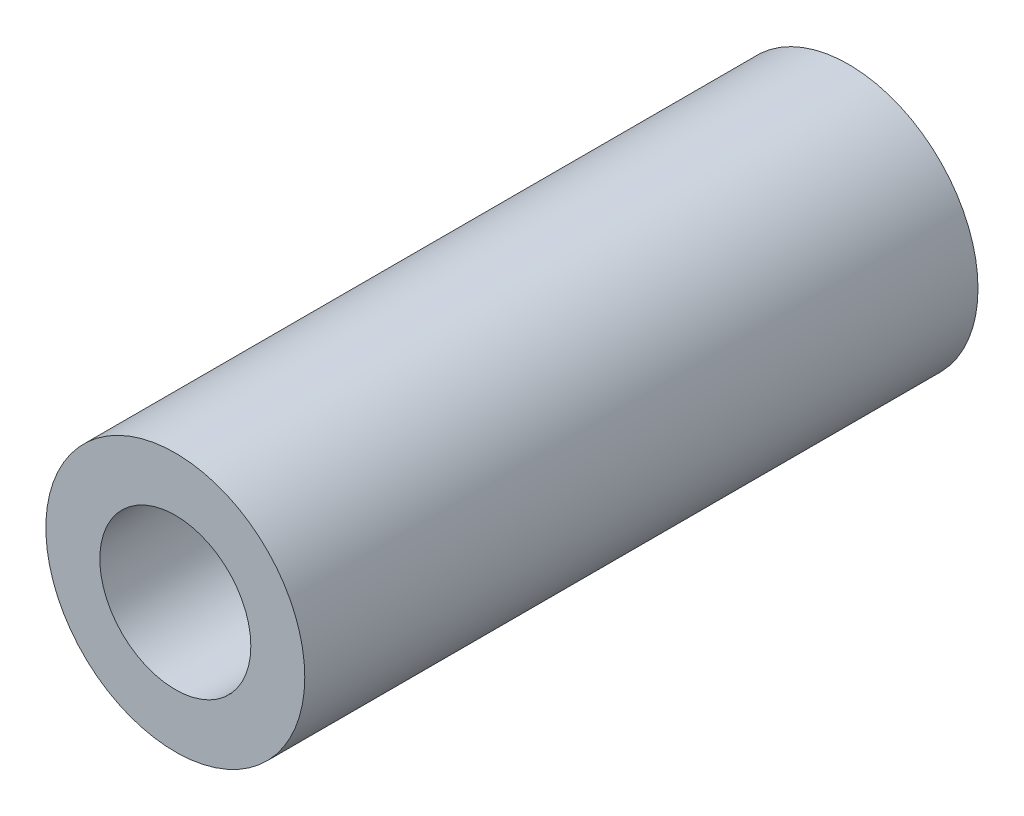
ISO-10303-21;
HEADER;
FILE_DESCRIPTION(('STEP AP214'),'2;1');
FILE_NAME('part.step','',(''),(''),'','','');
FILE_SCHEMA(('AUTOMOTIVE_DESIGN { 1 0 10303 214 1 1 1 1 }'));
ENDSEC;
DATA;
#1=APPLICATION_CONTEXT('core data for automotive mechanical design processes');
#2=APPLICATION_PROTOCOL_DEFINITION('international standard','automotive_design',2000,#1);
#3=PRODUCT_CONTEXT('',#1,'mechanical');
#4=PRODUCT('Part','Part','',(#3));
#5=PRODUCT_RELATED_PRODUCT_CATEGORY('part','',(#4));
#6=PRODUCT_DEFINITION_FORMATION('','',#4);
#7=PRODUCT_DEFINITION_CONTEXT('part definition',#1,'design');
#8=PRODUCT_DEFINITION('design','',#6,#7);
#9=PRODUCT_DEFINITION_SHAPE('','',#8);
#10=(LENGTH_UNIT() NAMED_UNIT(*) SI_UNIT(.MILLI.,.METRE.));
#11=(NAMED_UNIT(*) PLANE_ANGLE_UNIT() SI_UNIT($,.RADIAN.));
#12=(NAMED_UNIT(*) SI_UNIT($,.STERADIAN.) SOLID_ANGLE_UNIT());
#13=UNCERTAINTY_MEASURE_WITH_UNIT(LENGTH_MEASURE(1.E-05),#10,'distance_accuracy_value','');
#14=(GEOMETRIC_REPRESENTATION_CONTEXT(3) GLOBAL_UNCERTAINTY_ASSIGNED_CONTEXT((#13)) GLOBAL_UNIT_ASSIGNED_CONTEXT((#10,
#11,#12)) REPRESENTATION_CONTEXT('',''));
#15=CARTESIAN_POINT('',(0.,0.,0.));
#16=DIRECTION('',(0.,0.,1.));
#17=DIRECTION('',(1.,0.,0.));
#18=AXIS2_PLACEMENT_3D('',#15,#16,#17);
#19=CARTESIAN_POINT('',(0.,0.,15.6));
#20=DIRECTION('',(0.,0.,1.));
#21=DIRECTION('',(1.,0.,0.));
#22=AXIS2_PLACEMENT_3D('',#19,#20,#21);
#23=PLANE('',#22);
#24=CARTESIAN_POINT('',(0.,0.,15.6));
#25=DIRECTION('',(0.,0.,1.));
#26=DIRECTION('',(1.,0.,0.));
#27=AXIS2_PLACEMENT_3D('',#24,#25,#26);
#28=CIRCLE('',#27,6.);
#29=CARTESIAN_POINT('',(6.,0.,15.6));
#30=VERTEX_POINT('',#29);
#31=EDGE_CURVE('E10',#30,#30,#28,.T.);
#32=ORIENTED_EDGE('',*,*,#31,.T.);
#33=EDGE_LOOP('',(#32));
#34=FACE_BOUND('',#33,.T.);
#35=CARTESIAN_POINT('',(0.,0.,15.6));
#36=DIRECTION('',(0.,0.,1.));
#37=DIRECTION('',(1.,0.,0.));
#38=AXIS2_PLACEMENT_3D('',#35,#36,#37);
#39=CIRCLE('',#38,3.5);
#40=CARTESIAN_POINT('',(3.5,0.,15.6));
#41=VERTEX_POINT('',#40);
#42=EDGE_CURVE('E50',#41,#41,#39,.T.);
#43=ORIENTED_EDGE('',*,*,#42,.F.);
#44=EDGE_LOOP('',(#43));
#45=FACE_BOUND('',#44,.T.);
#46=ADVANCED_FACE('F37',(#34,#45),#23,.T.);
#47=CARTESIAN_POINT('',(0.,0.,-15.6));
#48=DIRECTION('',(0.,0.,1.));
#49=DIRECTION('',(1.,0.,0.));
#50=AXIS2_PLACEMENT_3D('',#47,#48,#49);
#51=PLANE('',#50);
#52=CARTESIAN_POINT('',(0.,0.,-15.6));
#53=DIRECTION('',(0.,0.,1.));
#54=DIRECTION('',(1.,0.,0.));
#55=AXIS2_PLACEMENT_3D('',#52,#53,#54);
#56=CIRCLE('',#55,6.);
#57=CARTESIAN_POINT('',(6.,0.,-15.6));
#58=VERTEX_POINT('',#57);
#59=EDGE_CURVE('E41',#58,#58,#56,.T.);
#60=ORIENTED_EDGE('',*,*,#59,.F.);
#61=EDGE_LOOP('',(#60));
#62=FACE_BOUND('',#61,.T.);
#63=CARTESIAN_POINT('',(0.,0.,-15.6));
#64=DIRECTION('',(0.,0.,1.));
#65=DIRECTION('',(1.,0.,0.));
#66=AXIS2_PLACEMENT_3D('',#63,#64,#65);
#67=CIRCLE('',#66,3.5);
#68=CARTESIAN_POINT('',(3.5,0.,-15.6));
#69=VERTEX_POINT('',#68);
#70=EDGE_CURVE('E52',#69,#69,#67,.T.);
#71=ORIENTED_EDGE('',*,*,#70,.T.);
#72=EDGE_LOOP('',(#71));
#73=FACE_BOUND('',#72,.T.);
#74=ADVANCED_FACE('F64',(#62,#73),#51,.F.);
#75=CARTESIAN_POINT('',(0.,0.,15.6));
#76=DIRECTION('',(0.,0.,-1.));
#77=DIRECTION('',(-1.,0.,0.));
#78=AXIS2_PLACEMENT_3D('',#75,#76,#77);
#79=CYLINDRICAL_SURFACE('',#78,6.);
#80=ORIENTED_EDGE('',*,*,#31,.F.);
#81=EDGE_LOOP('',(#80));
#82=FACE_BOUND('',#81,.T.);
#83=ORIENTED_EDGE('',*,*,#59,.T.);
#84=EDGE_LOOP('',(#83));
#85=FACE_BOUND('',#84,.T.);
#86=ADVANCED_FACE('F39',(#82,#85),#79,.T.);
#87=CARTESIAN_POINT('',(0.,0.,15.6));
#88=DIRECTION('',(0.,0.,-1.));
#89=DIRECTION('',(-1.,0.,0.));
#90=AXIS2_PLACEMENT_3D('',#87,#88,#89);
#91=CYLINDRICAL_SURFACE('',#90,3.5);
#92=ORIENTED_EDGE('',*,*,#42,.T.);
#93=EDGE_LOOP('',(#92));
#94=FACE_BOUND('',#93,.T.);
#95=ORIENTED_EDGE('',*,*,#70,.F.);
#96=EDGE_LOOP('',(#95));
#97=FACE_BOUND('',#96,.T.);
#98=ADVANCED_FACE('F60',(#94,#97),#91,.F.);
#99=CLOSED_SHELL('',(#46,#74,#86,#98));
#100=MANIFOLD_SOLID_BREP('B2',#99);
#101=ADVANCED_BREP_SHAPE_REPRESENTATION('',(#18,#100),#14);
#102=SHAPE_DEFINITION_REPRESENTATION(#9,#101);
ENDSEC;
END-ISO-10303-21;
